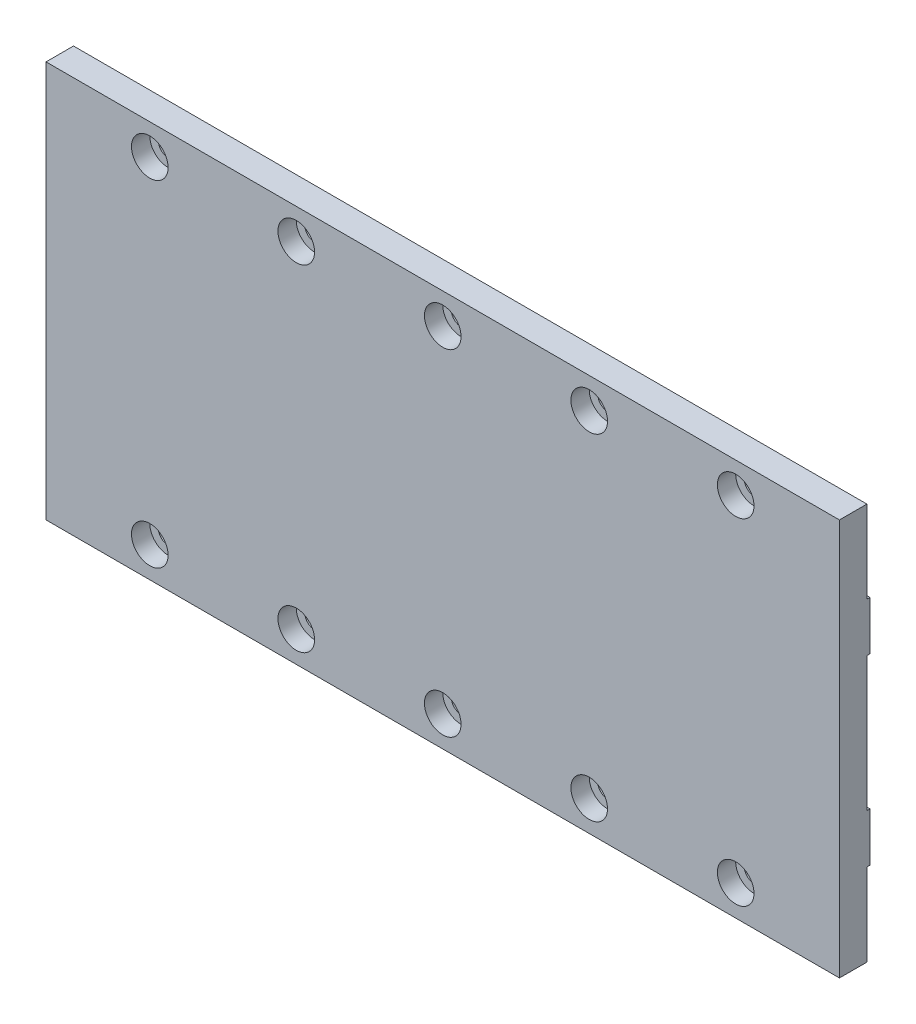
ISO-10303-21;
HEADER;
FILE_DESCRIPTION(('STEP AP214'),'2;1');
FILE_NAME('part.step','',(''),(''),'','','');
FILE_SCHEMA(('AUTOMOTIVE_DESIGN { 1 0 10303 214 1 1 1 1 }'));
ENDSEC;
DATA;
#1=APPLICATION_CONTEXT('core data for automotive mechanical design processes');
#2=APPLICATION_PROTOCOL_DEFINITION('international standard','automotive_design',2000,#1);
#3=PRODUCT_CONTEXT('',#1,'mechanical');
#4=PRODUCT('Part','Part','',(#3));
#5=PRODUCT_RELATED_PRODUCT_CATEGORY('part','',(#4));
#6=PRODUCT_DEFINITION_FORMATION('','',#4);
#7=PRODUCT_DEFINITION_CONTEXT('part definition',#1,'design');
#8=PRODUCT_DEFINITION('design','',#6,#7);
#9=PRODUCT_DEFINITION_SHAPE('','',#8);
#10=(LENGTH_UNIT() NAMED_UNIT(*) SI_UNIT(.MILLI.,.METRE.));
#11=(NAMED_UNIT(*) PLANE_ANGLE_UNIT() SI_UNIT($,.RADIAN.));
#12=(NAMED_UNIT(*) SI_UNIT($,.STERADIAN.) SOLID_ANGLE_UNIT());
#13=UNCERTAINTY_MEASURE_WITH_UNIT(LENGTH_MEASURE(1.E-05),#10,'distance_accuracy_value','');
#14=(GEOMETRIC_REPRESENTATION_CONTEXT(3) GLOBAL_UNCERTAINTY_ASSIGNED_CONTEXT((#13)) GLOBAL_UNIT_ASSIGNED_CONTEXT((#10,
#11,#12)) REPRESENTATION_CONTEXT('',''));
#15=CARTESIAN_POINT('',(0.,0.,0.));
#16=DIRECTION('',(0.,0.,1.));
#17=DIRECTION('',(1.,0.,0.));
#18=AXIS2_PLACEMENT_3D('',#15,#16,#17);
#19=CARTESIAN_POINT('',(113.,5.,5.));
#20=DIRECTION('',(0.,0.,-1.));
#21=DIRECTION('',(-1.,0.,0.));
#22=AXIS2_PLACEMENT_3D('',#19,#20,#21);
#23=CYLINDRICAL_SURFACE('',#22,1.59999999999999);
#24=CARTESIAN_POINT('',(113.,5.,0.5));
#25=DIRECTION('',(0.,0.,-1.));
#26=DIRECTION('',(-1.,0.,0.));
#27=AXIS2_PLACEMENT_3D('',#24,#25,#26);
#28=CIRCLE('',#27,1.59999999999999);
#29=CARTESIAN_POINT('',(111.4,5.,0.5));
#30=VERTEX_POINT('',#29);
#31=EDGE_CURVE('E249',#30,#30,#28,.T.);
#32=ORIENTED_EDGE('',*,*,#31,.T.);
#33=EDGE_LOOP('',(#32));
#34=FACE_BOUND('',#33,.T.);
#35=CARTESIAN_POINT('',(113.,5.,2.));
#36=DIRECTION('',(0.,0.,1.));
#37=DIRECTION('',(1.,0.,0.));
#38=AXIS2_PLACEMENT_3D('',#35,#36,#37);
#39=CIRCLE('',#38,1.59999999999999);
#40=CARTESIAN_POINT('',(114.6,5.,2.));
#41=VERTEX_POINT('',#40);
#42=EDGE_CURVE('E42',#41,#41,#39,.T.);
#43=ORIENTED_EDGE('',*,*,#42,.T.);
#44=EDGE_LOOP('',(#43));
#45=FACE_BOUND('',#44,.T.);
#46=ADVANCED_FACE('F38',(#34,#45),#23,.F.);
#47=CARTESIAN_POINT('',(89.,5.,5.));
#48=DIRECTION('',(0.,0.,-1.));
#49=DIRECTION('',(-1.,0.,0.));
#50=AXIS2_PLACEMENT_3D('',#47,#48,#49);
#51=CYLINDRICAL_SURFACE('',#50,1.60000000000001);
#52=CARTESIAN_POINT('',(89.,5.,0.5));
#53=DIRECTION('',(0.,0.,-1.));
#54=DIRECTION('',(-1.,0.,0.));
#55=AXIS2_PLACEMENT_3D('',#52,#53,#54);
#56=CIRCLE('',#55,1.60000000000001);
#57=CARTESIAN_POINT('',(87.4,5.,0.5));
#58=VERTEX_POINT('',#57);
#59=EDGE_CURVE('E245',#58,#58,#56,.T.);
#60=ORIENTED_EDGE('',*,*,#59,.T.);
#61=EDGE_LOOP('',(#60));
#62=FACE_BOUND('',#61,.T.);
#63=CARTESIAN_POINT('',(89.,5.,2.));
#64=DIRECTION('',(0.,0.,1.));
#65=DIRECTION('',(1.,0.,0.));
#66=AXIS2_PLACEMENT_3D('',#63,#64,#65);
#67=CIRCLE('',#66,1.60000000000001);
#68=CARTESIAN_POINT('',(90.6,5.,2.));
#69=VERTEX_POINT('',#68);
#70=EDGE_CURVE('E322',#69,#69,#67,.T.);
#71=ORIENTED_EDGE('',*,*,#70,.T.);
#72=EDGE_LOOP('',(#71));
#73=FACE_BOUND('',#72,.T.);
#74=ADVANCED_FACE('F436',(#62,#73),#51,.F.);
#75=CARTESIAN_POINT('',(65.,5.,5.));
#76=DIRECTION('',(0.,0.,-1.));
#77=DIRECTION('',(-1.,0.,0.));
#78=AXIS2_PLACEMENT_3D('',#75,#76,#77);
#79=CYLINDRICAL_SURFACE('',#78,1.60000000000001);
#80=CARTESIAN_POINT('',(65.,5.,0.5));
#81=DIRECTION('',(0.,0.,-1.));
#82=DIRECTION('',(-1.,0.,0.));
#83=AXIS2_PLACEMENT_3D('',#80,#81,#82);
#84=CIRCLE('',#83,1.60000000000001);
#85=CARTESIAN_POINT('',(63.4,5.,0.5));
#86=VERTEX_POINT('',#85);
#87=EDGE_CURVE('E241',#86,#86,#84,.T.);
#88=ORIENTED_EDGE('',*,*,#87,.T.);
#89=EDGE_LOOP('',(#88));
#90=FACE_BOUND('',#89,.T.);
#91=CARTESIAN_POINT('',(65.,5.,2.));
#92=DIRECTION('',(0.,0.,1.));
#93=DIRECTION('',(1.,0.,0.));
#94=AXIS2_PLACEMENT_3D('',#91,#92,#93);
#95=CIRCLE('',#94,1.60000000000001);
#96=CARTESIAN_POINT('',(66.6,5.,2.));
#97=VERTEX_POINT('',#96);
#98=EDGE_CURVE('E319',#97,#97,#95,.T.);
#99=ORIENTED_EDGE('',*,*,#98,.T.);
#100=EDGE_LOOP('',(#99));
#101=FACE_BOUND('',#100,.T.);
#102=ADVANCED_FACE('F443',(#90,#101),#79,.F.);
#103=CARTESIAN_POINT('',(41.,5.,5.));
#104=DIRECTION('',(0.,0.,-1.));
#105=DIRECTION('',(-1.,0.,0.));
#106=AXIS2_PLACEMENT_3D('',#103,#104,#105);
#107=CYLINDRICAL_SURFACE('',#106,1.6);
#108=CARTESIAN_POINT('',(41.,5.,0.5));
#109=DIRECTION('',(0.,0.,-1.));
#110=DIRECTION('',(-1.,0.,0.));
#111=AXIS2_PLACEMENT_3D('',#108,#109,#110);
#112=CIRCLE('',#111,1.6);
#113=CARTESIAN_POINT('',(39.4,5.,0.5));
#114=VERTEX_POINT('',#113);
#115=EDGE_CURVE('E237',#114,#114,#112,.T.);
#116=ORIENTED_EDGE('',*,*,#115,.T.);
#117=EDGE_LOOP('',(#116));
#118=FACE_BOUND('',#117,.T.);
#119=CARTESIAN_POINT('',(41.,5.,2.));
#120=DIRECTION('',(0.,0.,1.));
#121=DIRECTION('',(1.,0.,0.));
#122=AXIS2_PLACEMENT_3D('',#119,#120,#121);
#123=CIRCLE('',#122,1.6);
#124=CARTESIAN_POINT('',(42.6,5.,2.));
#125=VERTEX_POINT('',#124);
#126=EDGE_CURVE('E315',#125,#125,#123,.T.);
#127=ORIENTED_EDGE('',*,*,#126,.T.);
#128=EDGE_LOOP('',(#127));
#129=FACE_BOUND('',#128,.T.);
#130=ADVANCED_FACE('F595',(#118,#129),#107,.F.);
#131=CARTESIAN_POINT('',(17.,5.,5.));
#132=DIRECTION('',(0.,0.,-1.));
#133=DIRECTION('',(-1.,0.,0.));
#134=AXIS2_PLACEMENT_3D('',#131,#132,#133);
#135=CYLINDRICAL_SURFACE('',#134,1.6);
#136=CARTESIAN_POINT('',(17.,5.,0.5));
#137=DIRECTION('',(0.,0.,-1.));
#138=DIRECTION('',(-1.,0.,0.));
#139=AXIS2_PLACEMENT_3D('',#136,#137,#138);
#140=CIRCLE('',#139,1.6);
#141=CARTESIAN_POINT('',(15.4,5.,0.5));
#142=VERTEX_POINT('',#141);
#143=EDGE_CURVE('E236',#142,#142,#140,.T.);
#144=ORIENTED_EDGE('',*,*,#143,.T.);
#145=EDGE_LOOP('',(#144));
#146=FACE_BOUND('',#145,.T.);
#147=CARTESIAN_POINT('',(17.,5.,2.));
#148=DIRECTION('',(0.,0.,1.));
#149=DIRECTION('',(1.,0.,0.));
#150=AXIS2_PLACEMENT_3D('',#147,#148,#149);
#151=CIRCLE('',#150,1.6);
#152=CARTESIAN_POINT('',(18.6,5.,2.));
#153=VERTEX_POINT('',#152);
#154=EDGE_CURVE('E311',#153,#153,#151,.T.);
#155=ORIENTED_EDGE('',*,*,#154,.T.);
#156=EDGE_LOOP('',(#155));
#157=FACE_BOUND('',#156,.T.);
#158=ADVANCED_FACE('F585',(#146,#157),#135,.F.);
#159=CARTESIAN_POINT('',(113.,60.,5.));
#160=DIRECTION('',(0.,0.,-1.));
#161=DIRECTION('',(-1.,0.,0.));
#162=AXIS2_PLACEMENT_3D('',#159,#160,#161);
#163=CYLINDRICAL_SURFACE('',#162,1.60000000000001);
#164=CARTESIAN_POINT('',(113.,60.,0.5));
#165=DIRECTION('',(0.,0.,-1.));
#166=DIRECTION('',(-1.,0.,0.));
#167=AXIS2_PLACEMENT_3D('',#164,#165,#166);
#168=CIRCLE('',#167,1.60000000000001);
#169=CARTESIAN_POINT('',(111.4,60.,0.5));
#170=VERTEX_POINT('',#169);
#171=EDGE_CURVE('E232',#170,#170,#168,.T.);
#172=ORIENTED_EDGE('',*,*,#171,.T.);
#173=EDGE_LOOP('',(#172));
#174=FACE_BOUND('',#173,.T.);
#175=CARTESIAN_POINT('',(113.,60.,2.));
#176=DIRECTION('',(0.,0.,1.));
#177=DIRECTION('',(1.,0.,0.));
#178=AXIS2_PLACEMENT_3D('',#175,#176,#177);
#179=CIRCLE('',#178,1.60000000000001);
#180=CARTESIAN_POINT('',(114.6,60.,2.));
#181=VERTEX_POINT('',#180);
#182=EDGE_CURVE('E307',#181,#181,#179,.T.);
#183=ORIENTED_EDGE('',*,*,#182,.T.);
#184=EDGE_LOOP('',(#183));
#185=FACE_BOUND('',#184,.T.);
#186=ADVANCED_FACE('F575',(#174,#185),#163,.F.);
#187=CARTESIAN_POINT('',(89.,60.,5.));
#188=DIRECTION('',(0.,0.,-1.));
#189=DIRECTION('',(-1.,0.,0.));
#190=AXIS2_PLACEMENT_3D('',#187,#188,#189);
#191=CYLINDRICAL_SURFACE('',#190,1.60000000000001);
#192=CARTESIAN_POINT('',(89.,60.,0.5));
#193=DIRECTION('',(0.,0.,-1.));
#194=DIRECTION('',(-1.,0.,0.));
#195=AXIS2_PLACEMENT_3D('',#192,#193,#194);
#196=CIRCLE('',#195,1.60000000000001);
#197=CARTESIAN_POINT('',(87.4,60.,0.5));
#198=VERTEX_POINT('',#197);
#199=EDGE_CURVE('E228',#198,#198,#196,.T.);
#200=ORIENTED_EDGE('',*,*,#199,.T.);
#201=EDGE_LOOP('',(#200));
#202=FACE_BOUND('',#201,.T.);
#203=CARTESIAN_POINT('',(89.,60.,2.));
#204=DIRECTION('',(0.,0.,1.));
#205=DIRECTION('',(1.,0.,0.));
#206=AXIS2_PLACEMENT_3D('',#203,#204,#205);
#207=CIRCLE('',#206,1.60000000000001);
#208=CARTESIAN_POINT('',(90.6,60.,2.));
#209=VERTEX_POINT('',#208);
#210=EDGE_CURVE('E303',#209,#209,#207,.T.);
#211=ORIENTED_EDGE('',*,*,#210,.T.);
#212=EDGE_LOOP('',(#211));
#213=FACE_BOUND('',#212,.T.);
#214=ADVANCED_FACE('F565',(#202,#213),#191,.F.);
#215=CARTESIAN_POINT('',(65.,60.,5.));
#216=DIRECTION('',(0.,0.,-1.));
#217=DIRECTION('',(-1.,0.,0.));
#218=AXIS2_PLACEMENT_3D('',#215,#216,#217);
#219=CYLINDRICAL_SURFACE('',#218,1.60000000000001);
#220=CARTESIAN_POINT('',(65.,60.,0.5));
#221=DIRECTION('',(0.,0.,-1.));
#222=DIRECTION('',(-1.,0.,0.));
#223=AXIS2_PLACEMENT_3D('',#220,#221,#222);
#224=CIRCLE('',#223,1.60000000000001);
#225=CARTESIAN_POINT('',(63.4,60.,0.5));
#226=VERTEX_POINT('',#225);
#227=EDGE_CURVE('E224',#226,#226,#224,.T.);
#228=ORIENTED_EDGE('',*,*,#227,.T.);
#229=EDGE_LOOP('',(#228));
#230=FACE_BOUND('',#229,.T.);
#231=CARTESIAN_POINT('',(65.,60.,2.));
#232=DIRECTION('',(0.,0.,1.));
#233=DIRECTION('',(1.,0.,0.));
#234=AXIS2_PLACEMENT_3D('',#231,#232,#233);
#235=CIRCLE('',#234,1.60000000000001);
#236=CARTESIAN_POINT('',(66.6,60.,2.));
#237=VERTEX_POINT('',#236);
#238=EDGE_CURVE('E299',#237,#237,#235,.T.);
#239=ORIENTED_EDGE('',*,*,#238,.T.);
#240=EDGE_LOOP('',(#239));
#241=FACE_BOUND('',#240,.T.);
#242=ADVANCED_FACE('F555',(#230,#241),#219,.F.);
#243=CARTESIAN_POINT('',(41.,60.,5.));
#244=DIRECTION('',(0.,0.,-1.));
#245=DIRECTION('',(-1.,0.,0.));
#246=AXIS2_PLACEMENT_3D('',#243,#244,#245);
#247=CYLINDRICAL_SURFACE('',#246,1.6);
#248=CARTESIAN_POINT('',(41.,60.,0.5));
#249=DIRECTION('',(0.,0.,-1.));
#250=DIRECTION('',(-1.,0.,0.));
#251=AXIS2_PLACEMENT_3D('',#248,#249,#250);
#252=CIRCLE('',#251,1.6);
#253=CARTESIAN_POINT('',(39.4,60.,0.5));
#254=VERTEX_POINT('',#253);
#255=EDGE_CURVE('E220',#254,#254,#252,.T.);
#256=ORIENTED_EDGE('',*,*,#255,.T.);
#257=EDGE_LOOP('',(#256));
#258=FACE_BOUND('',#257,.T.);
#259=CARTESIAN_POINT('',(41.,60.,2.));
#260=DIRECTION('',(0.,0.,1.));
#261=DIRECTION('',(1.,0.,0.));
#262=AXIS2_PLACEMENT_3D('',#259,#260,#261);
#263=CIRCLE('',#262,1.6);
#264=CARTESIAN_POINT('',(42.6,60.,2.));
#265=VERTEX_POINT('',#264);
#266=EDGE_CURVE('E294',#265,#265,#263,.T.);
#267=ORIENTED_EDGE('',*,*,#266,.T.);
#268=EDGE_LOOP('',(#267));
#269=FACE_BOUND('',#268,.T.);
#270=ADVANCED_FACE('F545',(#258,#269),#247,.F.);
#271=CARTESIAN_POINT('',(17.,60.,5.));
#272=DIRECTION('',(0.,0.,-1.));
#273=DIRECTION('',(-1.,0.,0.));
#274=AXIS2_PLACEMENT_3D('',#271,#272,#273);
#275=CYLINDRICAL_SURFACE('',#274,1.6);
#276=CARTESIAN_POINT('',(17.,60.,0.5));
#277=DIRECTION('',(0.,0.,-1.));
#278=DIRECTION('',(-1.,0.,0.));
#279=AXIS2_PLACEMENT_3D('',#276,#277,#278);
#280=CIRCLE('',#279,1.6);
#281=CARTESIAN_POINT('',(15.4,60.,0.5));
#282=VERTEX_POINT('',#281);
#283=EDGE_CURVE('E163',#282,#282,#280,.T.);
#284=ORIENTED_EDGE('',*,*,#283,.T.);
#285=EDGE_LOOP('',(#284));
#286=FACE_BOUND('',#285,.T.);
#287=CARTESIAN_POINT('',(17.,60.,2.));
#288=DIRECTION('',(0.,0.,1.));
#289=DIRECTION('',(1.,0.,0.));
#290=AXIS2_PLACEMENT_3D('',#287,#288,#289);
#291=CIRCLE('',#290,1.6);
#292=CARTESIAN_POINT('',(18.6,60.,2.));
#293=VERTEX_POINT('',#292);
#294=EDGE_CURVE('E290',#293,#293,#291,.T.);
#295=ORIENTED_EDGE('',*,*,#294,.T.);
#296=EDGE_LOOP('',(#295));
#297=FACE_BOUND('',#296,.T.);
#298=ADVANCED_FACE('F465',(#286,#297),#275,.F.);
#299=CARTESIAN_POINT('',(0.,0.,0.));
#300=DIRECTION('',(0.,0.,-1.));
#301=DIRECTION('',(-1.,0.,0.));
#302=AXIS2_PLACEMENT_3D('',#299,#300,#301);
#303=PLANE('',#302);
#304=DIRECTION('',(-1.,0.,0.));
#305=VECTOR('',#304,1.);
#306=CARTESIAN_POINT('',(130.,51.5,0.));
#307=LINE('',#306,#305);
#308=CARTESIAN_POINT('',(130.,51.5,0.));
#309=VERTEX_POINT('',#308);
#310=CARTESIAN_POINT('',(0.,51.5,0.));
#311=VERTEX_POINT('',#310);
#312=EDGE_CURVE('E152',#309,#311,#307,.T.);
#313=ORIENTED_EDGE('',*,*,#312,.F.);
#314=DIRECTION('',(0.,1.,0.));
#315=VECTOR('',#314,1.);
#316=CARTESIAN_POINT('',(130.,0.,0.));
#317=LINE('',#316,#315);
#318=CARTESIAN_POINT('',(130.,43.5,0.));
#319=VERTEX_POINT('',#318);
#320=EDGE_CURVE('E158',#319,#309,#317,.T.);
#321=ORIENTED_EDGE('',*,*,#320,.F.);
#322=DIRECTION('',(1.,0.,0.));
#323=VECTOR('',#322,1.);
#324=CARTESIAN_POINT('',(130.,43.5,0.));
#325=LINE('',#324,#323);
#326=CARTESIAN_POINT('',(0.,43.5,0.));
#327=VERTEX_POINT('',#326);
#328=EDGE_CURVE('E194',#327,#319,#325,.T.);
#329=ORIENTED_EDGE('',*,*,#328,.F.);
#330=DIRECTION('',(0.,-1.,0.));
#331=VECTOR('',#330,1.);
#332=CARTESIAN_POINT('',(0.,0.,0.));
#333=LINE('',#332,#331);
#334=EDGE_CURVE('E272',#311,#327,#333,.T.);
#335=ORIENTED_EDGE('',*,*,#334,.F.);
#336=EDGE_LOOP('',(#313,#321,#329,#335));
#337=FACE_BOUND('',#336,.T.);
#338=ADVANCED_FACE('F403',(#337),#303,.T.);
#339=CARTESIAN_POINT('',(0.,0.,5.));
#340=DIRECTION('',(0.,1.,0.));
#341=DIRECTION('',(0.,0.,1.));
#342=AXIS2_PLACEMENT_3D('',#339,#340,#341);
#343=PLANE('',#342);
#344=DIRECTION('',(-1.,0.,0.));
#345=VECTOR('',#344,1.);
#346=CARTESIAN_POINT('',(0.,0.,0.5));
#347=LINE('',#346,#345);
#348=CARTESIAN_POINT('',(130.,0.,0.5));
#349=VERTEX_POINT('',#348);
#350=CARTESIAN_POINT('',(0.,0.,0.5));
#351=VERTEX_POINT('',#350);
#352=EDGE_CURVE('E177',#349,#351,#347,.T.);
#353=ORIENTED_EDGE('',*,*,#352,.F.);
#354=DIRECTION('',(0.,0.,-1.));
#355=VECTOR('',#354,1.);
#356=CARTESIAN_POINT('',(130.,0.,5.));
#357=LINE('',#356,#355);
#358=CARTESIAN_POINT('',(130.,0.,5.));
#359=VERTEX_POINT('',#358);
#360=EDGE_CURVE('E48',#359,#349,#357,.T.);
#361=ORIENTED_EDGE('',*,*,#360,.F.);
#362=DIRECTION('',(1.,0.,0.));
#363=VECTOR('',#362,1.);
#364=CARTESIAN_POINT('',(0.,0.,5.));
#365=LINE('',#364,#363);
#366=CARTESIAN_POINT('',(0.,0.,5.));
#367=VERTEX_POINT('',#366);
#368=EDGE_CURVE('E258',#367,#359,#365,.T.);
#369=ORIENTED_EDGE('',*,*,#368,.F.);
#370=DIRECTION('',(0.,0.,-1.));
#371=VECTOR('',#370,1.);
#372=CARTESIAN_POINT('',(0.,0.,5.));
#373=LINE('',#372,#371);
#374=EDGE_CURVE('E11',#367,#351,#373,.T.);
#375=ORIENTED_EDGE('',*,*,#374,.T.);
#376=EDGE_LOOP('',(#353,#361,#369,#375));
#377=FACE_BOUND('',#376,.T.);
#378=ADVANCED_FACE('F457',(#377),#343,.F.);
#379=CARTESIAN_POINT('',(0.,65.,5.));
#380=DIRECTION('',(0.,-1.,0.));
#381=DIRECTION('',(0.,0.,-1.));
#382=AXIS2_PLACEMENT_3D('',#379,#380,#381);
#383=PLANE('',#382);
#384=DIRECTION('',(1.,0.,0.));
#385=VECTOR('',#384,1.);
#386=CARTESIAN_POINT('',(130.,65.,0.5));
#387=LINE('',#386,#385);
#388=CARTESIAN_POINT('',(0.,65.,0.5));
#389=VERTEX_POINT('',#388);
#390=CARTESIAN_POINT('',(130.,65.,0.5));
#391=VERTEX_POINT('',#390);
#392=EDGE_CURVE('E147',#389,#391,#387,.T.);
#393=ORIENTED_EDGE('',*,*,#392,.F.);
#394=DIRECTION('',(0.,0.,-1.));
#395=VECTOR('',#394,1.);
#396=CARTESIAN_POINT('',(0.,65.,5.));
#397=LINE('',#396,#395);
#398=CARTESIAN_POINT('',(0.,65.,5.));
#399=VERTEX_POINT('',#398);
#400=EDGE_CURVE('E268',#399,#389,#397,.T.);
#401=ORIENTED_EDGE('',*,*,#400,.F.);
#402=DIRECTION('',(-1.,0.,0.));
#403=VECTOR('',#402,1.);
#404=CARTESIAN_POINT('',(0.,65.,5.));
#405=LINE('',#404,#403);
#406=CARTESIAN_POINT('',(130.,65.,5.));
#407=VERTEX_POINT('',#406);
#408=EDGE_CURVE('E265',#407,#399,#405,.T.);
#409=ORIENTED_EDGE('',*,*,#408,.F.);
#410=DIRECTION('',(0.,0.,-1.));
#411=VECTOR('',#410,1.);
#412=CARTESIAN_POINT('',(130.,65.,5.));
#413=LINE('',#412,#411);
#414=EDGE_CURVE('E278',#407,#391,#413,.T.);
#415=ORIENTED_EDGE('',*,*,#414,.T.);
#416=EDGE_LOOP('',(#393,#401,#409,#415));
#417=FACE_BOUND('',#416,.T.);
#418=ADVANCED_FACE('F451',(#417),#383,.F.);
#419=CARTESIAN_POINT('',(0.,0.,5.));
#420=DIRECTION('',(0.,0.,-1.));
#421=DIRECTION('',(-1.,0.,0.));
#422=AXIS2_PLACEMENT_3D('',#419,#420,#421);
#423=PLANE('',#422);
#424=CARTESIAN_POINT('',(17.,5.,5.));
#425=DIRECTION('',(0.,0.,1.));
#426=DIRECTION('',(1.,0.,0.));
#427=AXIS2_PLACEMENT_3D('',#424,#425,#426);
#428=CIRCLE('',#427,3.);
#429=CARTESIAN_POINT('',(20.,5.,5.));
#430=VERTEX_POINT('',#429);
#431=EDGE_CURVE('E383',#430,#430,#428,.T.);
#432=ORIENTED_EDGE('',*,*,#431,.F.);
#433=EDGE_LOOP('',(#432));
#434=FACE_BOUND('',#433,.T.);
#435=CARTESIAN_POINT('',(41.,5.,5.));
#436=DIRECTION('',(0.,0.,1.));
#437=DIRECTION('',(1.,0.,0.));
#438=AXIS2_PLACEMENT_3D('',#435,#436,#437);
#439=CIRCLE('',#438,3.);
#440=CARTESIAN_POINT('',(44.,5.,5.));
#441=VERTEX_POINT('',#440);
#442=EDGE_CURVE('E375',#441,#441,#439,.T.);
#443=ORIENTED_EDGE('',*,*,#442,.F.);
#444=EDGE_LOOP('',(#443));
#445=FACE_BOUND('',#444,.T.);
#446=CARTESIAN_POINT('',(65.,5.,5.));
#447=DIRECTION('',(0.,0.,1.));
#448=DIRECTION('',(1.,0.,0.));
#449=AXIS2_PLACEMENT_3D('',#446,#447,#448);
#450=CIRCLE('',#449,3.00000000000001);
#451=CARTESIAN_POINT('',(68.,5.,5.));
#452=VERTEX_POINT('',#451);
#453=EDGE_CURVE('E367',#452,#452,#450,.T.);
#454=ORIENTED_EDGE('',*,*,#453,.F.);
#455=EDGE_LOOP('',(#454));
#456=FACE_BOUND('',#455,.T.);
#457=CARTESIAN_POINT('',(89.,5.,5.));
#458=DIRECTION('',(0.,0.,1.));
#459=DIRECTION('',(1.,0.,0.));
#460=AXIS2_PLACEMENT_3D('',#457,#458,#459);
#461=CIRCLE('',#460,3.00000000000001);
#462=CARTESIAN_POINT('',(92.,5.,5.));
#463=VERTEX_POINT('',#462);
#464=EDGE_CURVE('E359',#463,#463,#461,.T.);
#465=ORIENTED_EDGE('',*,*,#464,.F.);
#466=EDGE_LOOP('',(#465));
#467=FACE_BOUND('',#466,.T.);
#468=CARTESIAN_POINT('',(113.,5.,5.));
#469=DIRECTION('',(0.,0.,1.));
#470=DIRECTION('',(1.,0.,0.));
#471=AXIS2_PLACEMENT_3D('',#468,#469,#470);
#472=CIRCLE('',#471,3.00000000000001);
#473=CARTESIAN_POINT('',(116.,5.,5.));
#474=VERTEX_POINT('',#473);
#475=EDGE_CURVE('E344',#474,#474,#472,.T.);
#476=ORIENTED_EDGE('',*,*,#475,.F.);
#477=EDGE_LOOP('',(#476));
#478=FACE_BOUND('',#477,.T.);
#479=CARTESIAN_POINT('',(113.,60.,5.));
#480=DIRECTION('',(0.,0.,1.));
#481=DIRECTION('',(1.,0.,0.));
#482=AXIS2_PLACEMENT_3D('',#479,#480,#481);
#483=CIRCLE('',#482,3.00000000000001);
#484=CARTESIAN_POINT('',(116.,60.,5.));
#485=VERTEX_POINT('',#484);
#486=EDGE_CURVE('E343',#485,#485,#483,.T.);
#487=ORIENTED_EDGE('',*,*,#486,.F.);
#488=EDGE_LOOP('',(#487));
#489=FACE_BOUND('',#488,.T.);
#490=CARTESIAN_POINT('',(89.,60.,5.));
#491=DIRECTION('',(0.,0.,1.));
#492=DIRECTION('',(1.,0.,0.));
#493=AXIS2_PLACEMENT_3D('',#490,#491,#492);
#494=CIRCLE('',#493,3.00000000000001);
#495=CARTESIAN_POINT('',(92.,60.,5.));
#496=VERTEX_POINT('',#495);
#497=EDGE_CURVE('E825',#496,#496,#494,.T.);
#498=ORIENTED_EDGE('',*,*,#497,.F.);
#499=EDGE_LOOP('',(#498));
#500=FACE_BOUND('',#499,.T.);
#501=CARTESIAN_POINT('',(65.,60.,5.));
#502=DIRECTION('',(0.,0.,1.));
#503=DIRECTION('',(1.,0.,0.));
#504=AXIS2_PLACEMENT_3D('',#501,#502,#503);
#505=CIRCLE('',#504,3.00000000000001);
#506=CARTESIAN_POINT('',(68.,60.,5.));
#507=VERTEX_POINT('',#506);
#508=EDGE_CURVE('E829',#507,#507,#505,.T.);
#509=ORIENTED_EDGE('',*,*,#508,.F.);
#510=EDGE_LOOP('',(#509));
#511=FACE_BOUND('',#510,.T.);
#512=CARTESIAN_POINT('',(41.,60.,5.));
#513=DIRECTION('',(0.,0.,1.));
#514=DIRECTION('',(1.,0.,0.));
#515=AXIS2_PLACEMENT_3D('',#512,#513,#514);
#516=CIRCLE('',#515,3.);
#517=CARTESIAN_POINT('',(44.,60.,5.));
#518=VERTEX_POINT('',#517);
#519=EDGE_CURVE('E833',#518,#518,#516,.T.);
#520=ORIENTED_EDGE('',*,*,#519,.F.);
#521=EDGE_LOOP('',(#520));
#522=FACE_BOUND('',#521,.T.);
#523=CARTESIAN_POINT('',(17.,60.,5.));
#524=DIRECTION('',(0.,0.,1.));
#525=DIRECTION('',(1.,0.,0.));
#526=AXIS2_PLACEMENT_3D('',#523,#524,#525);
#527=CIRCLE('',#526,3.);
#528=CARTESIAN_POINT('',(20.,60.,5.));
#529=VERTEX_POINT('',#528);
#530=EDGE_CURVE('E390',#529,#529,#527,.T.);
#531=ORIENTED_EDGE('',*,*,#530,.F.);
#532=EDGE_LOOP('',(#531));
#533=FACE_BOUND('',#532,.T.);
#534=DIRECTION('',(0.,-1.,0.));
#535=VECTOR('',#534,1.);
#536=CARTESIAN_POINT('',(0.,0.,5.));
#537=LINE('',#536,#535);
#538=EDGE_CURVE('E254',#399,#367,#537,.T.);
#539=ORIENTED_EDGE('',*,*,#538,.T.);
#540=ORIENTED_EDGE('',*,*,#368,.T.);
#541=DIRECTION('',(0.,1.,0.));
#542=VECTOR('',#541,1.);
#543=CARTESIAN_POINT('',(130.,0.,5.));
#544=LINE('',#543,#542);
#545=EDGE_CURVE('E262',#359,#407,#544,.T.);
#546=ORIENTED_EDGE('',*,*,#545,.T.);
#547=ORIENTED_EDGE('',*,*,#408,.T.);
#548=EDGE_LOOP('',(#539,#540,#546,#547));
#549=FACE_BOUND('',#548,.T.);
#550=ADVANCED_FACE('F448',(#434,#445,#456,#467,#478,#489,#500,#511,#522,#533,#549),#423,.F.);
#551=DIRECTION('',(1.,0.,0.));
#552=VECTOR('',#551,1.);
#553=CARTESIAN_POINT('',(0.,13.5,0.));
#554=LINE('',#553,#552);
#555=CARTESIAN_POINT('',(0.,13.5,0.));
#556=VERTEX_POINT('',#555);
#557=CARTESIAN_POINT('',(130.,13.5,0.));
#558=VERTEX_POINT('',#557);
#559=EDGE_CURVE('E171',#556,#558,#554,.T.);
#560=ORIENTED_EDGE('',*,*,#559,.F.);
#561=CARTESIAN_POINT('',(0.,21.5,0.));
#562=VERTEX_POINT('',#561);
#563=EDGE_CURVE('E253',#562,#556,#333,.T.);
#564=ORIENTED_EDGE('',*,*,#563,.F.);
#565=DIRECTION('',(-1.,0.,0.));
#566=VECTOR('',#565,1.);
#567=CARTESIAN_POINT('',(130.,21.5,0.));
#568=LINE('',#567,#566);
#569=CARTESIAN_POINT('',(130.,21.5,0.));
#570=VERTEX_POINT('',#569);
#571=EDGE_CURVE('E204',#570,#562,#568,.T.);
#572=ORIENTED_EDGE('',*,*,#571,.F.);
#573=EDGE_CURVE('E259',#558,#570,#317,.T.);
#574=ORIENTED_EDGE('',*,*,#573,.F.);
#575=EDGE_LOOP('',(#560,#564,#572,#574));
#576=FACE_BOUND('',#575,.T.);
#577=ADVANCED_FACE('F414',(#576),#303,.T.);
#578=CARTESIAN_POINT('',(0.,0.,5.));
#579=DIRECTION('',(1.,0.,0.));
#580=DIRECTION('',(0.,0.,-1.));
#581=AXIS2_PLACEMENT_3D('',#578,#579,#580);
#582=PLANE('',#581);
#583=DIRECTION('',(0.,1.,0.));
#584=VECTOR('',#583,1.);
#585=CARTESIAN_POINT('',(0.,65.,0.5));
#586=LINE('',#585,#584);
#587=CARTESIAN_POINT('',(0.,51.5,0.5));
#588=VERTEX_POINT('',#587);
#589=EDGE_CURVE('E141',#588,#389,#586,.T.);
#590=ORIENTED_EDGE('',*,*,#589,.F.);
#591=DIRECTION('',(0.,0.,-1.));
#592=VECTOR('',#591,1.);
#593=CARTESIAN_POINT('',(0.,51.5,0.5));
#594=LINE('',#593,#592);
#595=EDGE_CURVE('E137',#588,#311,#594,.T.);
#596=ORIENTED_EDGE('',*,*,#595,.T.);
#597=ORIENTED_EDGE('',*,*,#334,.T.);
#598=DIRECTION('',(0.,0.,-1.));
#599=VECTOR('',#598,1.);
#600=CARTESIAN_POINT('',(0.,43.5,0.5));
#601=LINE('',#600,#599);
#602=CARTESIAN_POINT('',(0.,43.5,0.5));
#603=VERTEX_POINT('',#602);
#604=EDGE_CURVE('E211',#603,#327,#601,.T.);
#605=ORIENTED_EDGE('',*,*,#604,.F.);
#606=DIRECTION('',(0.,1.,0.));
#607=VECTOR('',#606,1.);
#608=CARTESIAN_POINT('',(0.,43.5,0.5));
#609=LINE('',#608,#607);
#610=CARTESIAN_POINT('',(0.,21.5,0.5));
#611=VERTEX_POINT('',#610);
#612=EDGE_CURVE('E198',#611,#603,#609,.T.);
#613=ORIENTED_EDGE('',*,*,#612,.F.);
#614=DIRECTION('',(0.,0.,-1.));
#615=VECTOR('',#614,1.);
#616=CARTESIAN_POINT('',(0.,21.5,0.5));
#617=LINE('',#616,#615);
#618=EDGE_CURVE('E214',#611,#562,#617,.T.);
#619=ORIENTED_EDGE('',*,*,#618,.T.);
#620=ORIENTED_EDGE('',*,*,#563,.T.);
#621=DIRECTION('',(0.,0.,-1.));
#622=VECTOR('',#621,1.);
#623=CARTESIAN_POINT('',(0.,13.5,0.5));
#624=LINE('',#623,#622);
#625=CARTESIAN_POINT('',(0.,13.5,0.5));
#626=VERTEX_POINT('',#625);
#627=EDGE_CURVE('E180',#626,#556,#624,.T.);
#628=ORIENTED_EDGE('',*,*,#627,.F.);
#629=DIRECTION('',(0.,1.,0.));
#630=VECTOR('',#629,1.);
#631=CARTESIAN_POINT('',(0.,0.,0.5));
#632=LINE('',#631,#630);
#633=EDGE_CURVE('E168',#351,#626,#632,.T.);
#634=ORIENTED_EDGE('',*,*,#633,.F.);
#635=ORIENTED_EDGE('',*,*,#374,.F.);
#636=ORIENTED_EDGE('',*,*,#538,.F.);
#637=ORIENTED_EDGE('',*,*,#400,.T.);
#638=EDGE_LOOP('',(#590,#596,#597,#605,#613,#619,#620,#628,#634,#635,#636,#637));
#639=FACE_BOUND('',#638,.T.);
#640=ADVANCED_FACE('F40',(#639),#582,.F.);
#641=CARTESIAN_POINT('',(130.,0.,5.));
#642=DIRECTION('',(-1.,0.,0.));
#643=DIRECTION('',(0.,0.,1.));
#644=AXIS2_PLACEMENT_3D('',#641,#642,#643);
#645=PLANE('',#644);
#646=ORIENTED_EDGE('',*,*,#320,.T.);
#647=DIRECTION('',(0.,0.,-1.));
#648=VECTOR('',#647,1.);
#649=CARTESIAN_POINT('',(130.,51.5,0.5));
#650=LINE('',#649,#648);
#651=CARTESIAN_POINT('',(130.,51.5,0.5));
#652=VERTEX_POINT('',#651);
#653=EDGE_CURVE('E134',#652,#309,#650,.T.);
#654=ORIENTED_EDGE('',*,*,#653,.F.);
#655=DIRECTION('',(0.,-1.,0.));
#656=VECTOR('',#655,1.);
#657=CARTESIAN_POINT('',(130.,65.,0.5));
#658=LINE('',#657,#656);
#659=EDGE_CURVE('E142',#391,#652,#658,.T.);
#660=ORIENTED_EDGE('',*,*,#659,.F.);
#661=ORIENTED_EDGE('',*,*,#414,.F.);
#662=ORIENTED_EDGE('',*,*,#545,.F.);
#663=ORIENTED_EDGE('',*,*,#360,.T.);
#664=DIRECTION('',(0.,-1.,0.));
#665=VECTOR('',#664,1.);
#666=CARTESIAN_POINT('',(130.,0.,0.5));
#667=LINE('',#666,#665);
#668=CARTESIAN_POINT('',(130.,13.5,0.5));
#669=VERTEX_POINT('',#668);
#670=EDGE_CURVE('E174',#669,#349,#667,.T.);
#671=ORIENTED_EDGE('',*,*,#670,.F.);
#672=DIRECTION('',(0.,0.,-1.));
#673=VECTOR('',#672,1.);
#674=CARTESIAN_POINT('',(130.,13.5,0.5));
#675=LINE('',#674,#673);
#676=EDGE_CURVE('E184',#669,#558,#675,.T.);
#677=ORIENTED_EDGE('',*,*,#676,.T.);
#678=ORIENTED_EDGE('',*,*,#573,.T.);
#679=DIRECTION('',(0.,0.,-1.));
#680=VECTOR('',#679,1.);
#681=CARTESIAN_POINT('',(130.,21.5,0.5));
#682=LINE('',#681,#680);
#683=CARTESIAN_POINT('',(130.,21.5,0.5));
#684=VERTEX_POINT('',#683);
#685=EDGE_CURVE('E203',#684,#570,#682,.T.);
#686=ORIENTED_EDGE('',*,*,#685,.F.);
#687=DIRECTION('',(0.,-1.,0.));
#688=VECTOR('',#687,1.);
#689=CARTESIAN_POINT('',(130.,43.5,0.5));
#690=LINE('',#689,#688);
#691=CARTESIAN_POINT('',(130.,43.5,0.5));
#692=VERTEX_POINT('',#691);
#693=EDGE_CURVE('E190',#692,#684,#690,.T.);
#694=ORIENTED_EDGE('',*,*,#693,.F.);
#695=DIRECTION('',(0.,0.,-1.));
#696=VECTOR('',#695,1.);
#697=CARTESIAN_POINT('',(130.,43.5,0.5));
#698=LINE('',#697,#696);
#699=EDGE_CURVE('E183',#692,#319,#698,.T.);
#700=ORIENTED_EDGE('',*,*,#699,.T.);
#701=EDGE_LOOP('',(#646,#654,#660,#661,#662,#663,#671,#677,#678,#686,#694,#700));
#702=FACE_BOUND('',#701,.T.);
#703=ADVANCED_FACE('F155',(#702),#645,.F.);
#704=CARTESIAN_POINT('',(130.,51.5,0.5));
#705=DIRECTION('',(0.,-1.,0.));
#706=DIRECTION('',(0.,0.,-1.));
#707=AXIS2_PLACEMENT_3D('',#704,#705,#706);
#708=PLANE('',#707);
#709=ORIENTED_EDGE('',*,*,#312,.T.);
#710=ORIENTED_EDGE('',*,*,#595,.F.);
#711=DIRECTION('',(-1.,0.,0.));
#712=VECTOR('',#711,1.);
#713=CARTESIAN_POINT('',(130.,51.5,0.5));
#714=LINE('',#713,#712);
#715=EDGE_CURVE('E130',#652,#588,#714,.T.);
#716=ORIENTED_EDGE('',*,*,#715,.F.);
#717=ORIENTED_EDGE('',*,*,#653,.T.);
#718=EDGE_LOOP('',(#709,#710,#716,#717));
#719=FACE_BOUND('',#718,.T.);
#720=ADVANCED_FACE('F132',(#719),#708,.F.);
#721=CARTESIAN_POINT('',(0.,0.,0.5));
#722=DIRECTION('',(0.,0.,-1.));
#723=DIRECTION('',(-1.,0.,0.));
#724=AXIS2_PLACEMENT_3D('',#721,#722,#723);
#725=PLANE('',#724);
#726=ORIENTED_EDGE('',*,*,#171,.F.);
#727=EDGE_LOOP('',(#726));
#728=FACE_BOUND('',#727,.T.);
#729=ORIENTED_EDGE('',*,*,#199,.F.);
#730=EDGE_LOOP('',(#729));
#731=FACE_BOUND('',#730,.T.);
#732=ORIENTED_EDGE('',*,*,#227,.F.);
#733=EDGE_LOOP('',(#732));
#734=FACE_BOUND('',#733,.T.);
#735=ORIENTED_EDGE('',*,*,#255,.F.);
#736=EDGE_LOOP('',(#735));
#737=FACE_BOUND('',#736,.T.);
#738=ORIENTED_EDGE('',*,*,#283,.F.);
#739=EDGE_LOOP('',(#738));
#740=FACE_BOUND('',#739,.T.);
#741=ORIENTED_EDGE('',*,*,#659,.T.);
#742=ORIENTED_EDGE('',*,*,#715,.T.);
#743=ORIENTED_EDGE('',*,*,#589,.T.);
#744=ORIENTED_EDGE('',*,*,#392,.T.);
#745=EDGE_LOOP('',(#741,#742,#743,#744));
#746=FACE_BOUND('',#745,.T.);
#747=ADVANCED_FACE('F145',(#728,#731,#734,#737,#740,#746),#725,.T.);
#748=CARTESIAN_POINT('',(0.,13.5,0.5));
#749=DIRECTION('',(0.,1.,0.));
#750=DIRECTION('',(-1.,0.,0.));
#751=AXIS2_PLACEMENT_3D('',#748,#749,#750);
#752=PLANE('',#751);
#753=ORIENTED_EDGE('',*,*,#559,.T.);
#754=ORIENTED_EDGE('',*,*,#676,.F.);
#755=DIRECTION('',(1.,0.,0.));
#756=VECTOR('',#755,1.);
#757=CARTESIAN_POINT('',(0.,13.5,0.5));
#758=LINE('',#757,#756);
#759=EDGE_CURVE('E56',#626,#669,#758,.T.);
#760=ORIENTED_EDGE('',*,*,#759,.F.);
#761=ORIENTED_EDGE('',*,*,#627,.T.);
#762=EDGE_LOOP('',(#753,#754,#760,#761));
#763=FACE_BOUND('',#762,.T.);
#764=ADVANCED_FACE('F431',(#763),#752,.F.);
#765=CARTESIAN_POINT('',(0.,0.,0.5));
#766=DIRECTION('',(0.,0.,-1.));
#767=DIRECTION('',(-1.,0.,0.));
#768=AXIS2_PLACEMENT_3D('',#765,#766,#767);
#769=PLANE('',#768);
#770=ORIENTED_EDGE('',*,*,#31,.F.);
#771=EDGE_LOOP('',(#770));
#772=FACE_BOUND('',#771,.T.);
#773=ORIENTED_EDGE('',*,*,#59,.F.);
#774=EDGE_LOOP('',(#773));
#775=FACE_BOUND('',#774,.T.);
#776=ORIENTED_EDGE('',*,*,#87,.F.);
#777=EDGE_LOOP('',(#776));
#778=FACE_BOUND('',#777,.T.);
#779=ORIENTED_EDGE('',*,*,#115,.F.);
#780=EDGE_LOOP('',(#779));
#781=FACE_BOUND('',#780,.T.);
#782=ORIENTED_EDGE('',*,*,#143,.F.);
#783=EDGE_LOOP('',(#782));
#784=FACE_BOUND('',#783,.T.);
#785=ORIENTED_EDGE('',*,*,#633,.T.);
#786=ORIENTED_EDGE('',*,*,#759,.T.);
#787=ORIENTED_EDGE('',*,*,#670,.T.);
#788=ORIENTED_EDGE('',*,*,#352,.T.);
#789=EDGE_LOOP('',(#785,#786,#787,#788));
#790=FACE_BOUND('',#789,.T.);
#791=ADVANCED_FACE('F424',(#772,#775,#778,#781,#784,#790),#769,.T.);
#792=CARTESIAN_POINT('',(130.,43.5,0.5));
#793=DIRECTION('',(0.,1.,0.));
#794=DIRECTION('',(0.,0.,1.));
#795=AXIS2_PLACEMENT_3D('',#792,#793,#794);
#796=PLANE('',#795);
#797=ORIENTED_EDGE('',*,*,#328,.T.);
#798=ORIENTED_EDGE('',*,*,#699,.F.);
#799=DIRECTION('',(1.,0.,0.));
#800=VECTOR('',#799,1.);
#801=CARTESIAN_POINT('',(130.,43.5,0.5));
#802=LINE('',#801,#800);
#803=EDGE_CURVE('E64',#603,#692,#802,.T.);
#804=ORIENTED_EDGE('',*,*,#803,.F.);
#805=ORIENTED_EDGE('',*,*,#604,.T.);
#806=EDGE_LOOP('',(#797,#798,#804,#805));
#807=FACE_BOUND('',#806,.T.);
#808=ADVANCED_FACE('F422',(#807),#796,.F.);
#809=CARTESIAN_POINT('',(130.,21.5,0.5));
#810=DIRECTION('',(0.,-1.,0.));
#811=DIRECTION('',(0.,0.,-1.));
#812=AXIS2_PLACEMENT_3D('',#809,#810,#811);
#813=PLANE('',#812);
#814=ORIENTED_EDGE('',*,*,#571,.T.);
#815=ORIENTED_EDGE('',*,*,#618,.F.);
#816=DIRECTION('',(-1.,0.,0.));
#817=VECTOR('',#816,1.);
#818=CARTESIAN_POINT('',(130.,21.5,0.5));
#819=LINE('',#818,#817);
#820=EDGE_CURVE('E193',#684,#611,#819,.T.);
#821=ORIENTED_EDGE('',*,*,#820,.F.);
#822=ORIENTED_EDGE('',*,*,#685,.T.);
#823=EDGE_LOOP('',(#814,#815,#821,#822));
#824=FACE_BOUND('',#823,.T.);
#825=ADVANCED_FACE('F417',(#824),#813,.F.);
#826=CARTESIAN_POINT('',(0.,0.,0.5));
#827=DIRECTION('',(0.,0.,-1.));
#828=DIRECTION('',(-1.,0.,0.));
#829=AXIS2_PLACEMENT_3D('',#826,#827,#828);
#830=PLANE('',#829);
#831=ORIENTED_EDGE('',*,*,#693,.T.);
#832=ORIENTED_EDGE('',*,*,#820,.T.);
#833=ORIENTED_EDGE('',*,*,#612,.T.);
#834=ORIENTED_EDGE('',*,*,#803,.T.);
#835=EDGE_LOOP('',(#831,#832,#833,#834));
#836=FACE_BOUND('',#835,.T.);
#837=ADVANCED_FACE('F420',(#836),#830,.T.);
#838=CARTESIAN_POINT('',(17.,60.,2.));
#839=DIRECTION('',(0.,0.,1.));
#840=DIRECTION('',(1.,0.,0.));
#841=AXIS2_PLACEMENT_3D('',#838,#839,#840);
#842=CYLINDRICAL_SURFACE('',#841,3.);
#843=CARTESIAN_POINT('',(17.,60.,2.));
#844=DIRECTION('',(0.,0.,1.));
#845=DIRECTION('',(1.,0.,0.));
#846=AXIS2_PLACEMENT_3D('',#843,#844,#845);
#847=CIRCLE('',#846,3.);
#848=CARTESIAN_POINT('',(20.,60.,2.));
#849=VERTEX_POINT('',#848);
#850=EDGE_CURVE('E295',#849,#849,#847,.T.);
#851=ORIENTED_EDGE('',*,*,#850,.F.);
#852=EDGE_LOOP('',(#851));
#853=FACE_BOUND('',#852,.T.);
#854=ORIENTED_EDGE('',*,*,#530,.T.);
#855=EDGE_LOOP('',(#854));
#856=FACE_BOUND('',#855,.T.);
#857=ADVANCED_FACE('F485',(#853,#856),#842,.F.);
#858=CARTESIAN_POINT('',(17.,60.,2.));
#859=DIRECTION('',(0.,0.,1.));
#860=DIRECTION('',(1.,0.,0.));
#861=AXIS2_PLACEMENT_3D('',#858,#859,#860);
#862=PLANE('',#861);
#863=ORIENTED_EDGE('',*,*,#294,.F.);
#864=EDGE_LOOP('',(#863));
#865=FACE_BOUND('',#864,.T.);
#866=ORIENTED_EDGE('',*,*,#850,.T.);
#867=EDGE_LOOP('',(#866));
#868=FACE_BOUND('',#867,.T.);
#869=ADVANCED_FACE('F489',(#865,#868),#862,.T.);
#870=CARTESIAN_POINT('',(41.,60.,2.));
#871=DIRECTION('',(0.,0.,1.));
#872=DIRECTION('',(1.,0.,0.));
#873=AXIS2_PLACEMENT_3D('',#870,#871,#872);
#874=CYLINDRICAL_SURFACE('',#873,3.);
#875=CARTESIAN_POINT('',(41.,60.,2.));
#876=DIRECTION('',(0.,0.,1.));
#877=DIRECTION('',(1.,0.,0.));
#878=AXIS2_PLACEMENT_3D('',#875,#876,#877);
#879=CIRCLE('',#878,3.);
#880=CARTESIAN_POINT('',(44.,60.,2.));
#881=VERTEX_POINT('',#880);
#882=EDGE_CURVE('E393',#881,#881,#879,.T.);
#883=ORIENTED_EDGE('',*,*,#882,.F.);
#884=EDGE_LOOP('',(#883));
#885=FACE_BOUND('',#884,.T.);
#886=ORIENTED_EDGE('',*,*,#519,.T.);
#887=EDGE_LOOP('',(#886));
#888=FACE_BOUND('',#887,.T.);
#889=ADVANCED_FACE('F496',(#885,#888),#874,.F.);
#890=CARTESIAN_POINT('',(41.,60.,2.));
#891=DIRECTION('',(0.,0.,1.));
#892=DIRECTION('',(1.,0.,0.));
#893=AXIS2_PLACEMENT_3D('',#890,#891,#892);
#894=PLANE('',#893);
#895=ORIENTED_EDGE('',*,*,#266,.F.);
#896=EDGE_LOOP('',(#895));
#897=FACE_BOUND('',#896,.T.);
#898=ORIENTED_EDGE('',*,*,#882,.T.);
#899=EDGE_LOOP('',(#898));
#900=FACE_BOUND('',#899,.T.);
#901=ADVANCED_FACE('F640',(#897,#900),#894,.T.);
#902=CARTESIAN_POINT('',(65.,60.,2.));
#903=DIRECTION('',(0.,0.,1.));
#904=DIRECTION('',(1.,0.,0.));
#905=AXIS2_PLACEMENT_3D('',#902,#903,#904);
#906=CYLINDRICAL_SURFACE('',#905,3.00000000000001);
#907=CARTESIAN_POINT('',(65.,60.,2.));
#908=DIRECTION('',(0.,0.,1.));
#909=DIRECTION('',(1.,0.,0.));
#910=AXIS2_PLACEMENT_3D('',#907,#908,#909);
#911=CIRCLE('',#910,3.00000000000001);
#912=CARTESIAN_POINT('',(68.,60.,2.));
#913=VERTEX_POINT('',#912);
#914=EDGE_CURVE('E837',#913,#913,#911,.T.);
#915=ORIENTED_EDGE('',*,*,#914,.F.);
#916=EDGE_LOOP('',(#915));
#917=FACE_BOUND('',#916,.T.);
#918=ORIENTED_EDGE('',*,*,#508,.T.);
#919=EDGE_LOOP('',(#918));
#920=FACE_BOUND('',#919,.T.);
#921=ADVANCED_FACE('F649',(#917,#920),#906,.F.);
#922=CARTESIAN_POINT('',(65.,60.,2.));
#923=DIRECTION('',(0.,0.,1.));
#924=DIRECTION('',(1.,0.,0.));
#925=AXIS2_PLACEMENT_3D('',#922,#923,#924);
#926=PLANE('',#925);
#927=ORIENTED_EDGE('',*,*,#238,.F.);
#928=EDGE_LOOP('',(#927));
#929=FACE_BOUND('',#928,.T.);
#930=ORIENTED_EDGE('',*,*,#914,.T.);
#931=EDGE_LOOP('',(#930));
#932=FACE_BOUND('',#931,.T.);
#933=ADVANCED_FACE('F658',(#929,#932),#926,.T.);
#934=CARTESIAN_POINT('',(89.,60.,2.));
#935=DIRECTION('',(0.,0.,1.));
#936=DIRECTION('',(1.,0.,0.));
#937=AXIS2_PLACEMENT_3D('',#934,#935,#936);
#938=CYLINDRICAL_SURFACE('',#937,3.00000000000001);
#939=CARTESIAN_POINT('',(89.,60.,2.));
#940=DIRECTION('',(0.,0.,1.));
#941=DIRECTION('',(1.,0.,0.));
#942=AXIS2_PLACEMENT_3D('',#939,#940,#941);
#943=CIRCLE('',#942,3.00000000000001);
#944=CARTESIAN_POINT('',(92.,60.,2.));
#945=VERTEX_POINT('',#944);
#946=EDGE_CURVE('E848',#945,#945,#943,.T.);
#947=ORIENTED_EDGE('',*,*,#946,.F.);
#948=EDGE_LOOP('',(#947));
#949=FACE_BOUND('',#948,.T.);
#950=ORIENTED_EDGE('',*,*,#497,.T.);
#951=EDGE_LOOP('',(#950));
#952=FACE_BOUND('',#951,.T.);
#953=ADVANCED_FACE('F667',(#949,#952),#938,.F.);
#954=CARTESIAN_POINT('',(89.,60.,2.));
#955=DIRECTION('',(0.,0.,1.));
#956=DIRECTION('',(1.,0.,0.));
#957=AXIS2_PLACEMENT_3D('',#954,#955,#956);
#958=PLANE('',#957);
#959=ORIENTED_EDGE('',*,*,#210,.F.);
#960=EDGE_LOOP('',(#959));
#961=FACE_BOUND('',#960,.T.);
#962=ORIENTED_EDGE('',*,*,#946,.T.);
#963=EDGE_LOOP('',(#962));
#964=FACE_BOUND('',#963,.T.);
#965=ADVANCED_FACE('F676',(#961,#964),#958,.T.);
#966=CARTESIAN_POINT('',(113.,60.,2.));
#967=DIRECTION('',(0.,0.,1.));
#968=DIRECTION('',(1.,0.,0.));
#969=AXIS2_PLACEMENT_3D('',#966,#967,#968);
#970=CYLINDRICAL_SURFACE('',#969,3.00000000000001);
#971=CARTESIAN_POINT('',(113.,60.,2.));
#972=DIRECTION('',(0.,0.,1.));
#973=DIRECTION('',(1.,0.,0.));
#974=AXIS2_PLACEMENT_3D('',#971,#972,#973);
#975=CIRCLE('',#974,3.00000000000001);
#976=CARTESIAN_POINT('',(116.,60.,2.));
#977=VERTEX_POINT('',#976);
#978=EDGE_CURVE('E349',#977,#977,#975,.T.);
#979=ORIENTED_EDGE('',*,*,#978,.F.);
#980=EDGE_LOOP('',(#979));
#981=FACE_BOUND('',#980,.T.);
#982=ORIENTED_EDGE('',*,*,#486,.T.);
#983=EDGE_LOOP('',(#982));
#984=FACE_BOUND('',#983,.T.);
#985=ADVANCED_FACE('F685',(#981,#984),#970,.F.);
#986=CARTESIAN_POINT('',(113.,60.,2.));
#987=DIRECTION('',(0.,0.,1.));
#988=DIRECTION('',(1.,0.,0.));
#989=AXIS2_PLACEMENT_3D('',#986,#987,#988);
#990=PLANE('',#989);
#991=ORIENTED_EDGE('',*,*,#182,.F.);
#992=EDGE_LOOP('',(#991));
#993=FACE_BOUND('',#992,.T.);
#994=ORIENTED_EDGE('',*,*,#978,.T.);
#995=EDGE_LOOP('',(#994));
#996=FACE_BOUND('',#995,.T.);
#997=ADVANCED_FACE('F694',(#993,#996),#990,.T.);
#998=CARTESIAN_POINT('',(113.,5.,2.));
#999=DIRECTION('',(0.,0.,1.));
#1000=DIRECTION('',(1.,0.,0.));
#1001=AXIS2_PLACEMENT_3D('',#998,#999,#1000);
#1002=CYLINDRICAL_SURFACE('',#1001,3.00000000000001);
#1003=CARTESIAN_POINT('',(113.,5.,2.));
#1004=DIRECTION('',(0.,0.,1.));
#1005=DIRECTION('',(1.,0.,0.));
#1006=AXIS2_PLACEMENT_3D('',#1003,#1004,#1005);
#1007=CIRCLE('',#1006,3.00000000000001);
#1008=CARTESIAN_POINT('',(116.,5.,2.));
#1009=VERTEX_POINT('',#1008);
#1010=EDGE_CURVE('E340',#1009,#1009,#1007,.T.);
#1011=ORIENTED_EDGE('',*,*,#1010,.F.);
#1012=EDGE_LOOP('',(#1011));
#1013=FACE_BOUND('',#1012,.T.);
#1014=ORIENTED_EDGE('',*,*,#475,.T.);
#1015=EDGE_LOOP('',(#1014));
#1016=FACE_BOUND('',#1015,.T.);
#1017=ADVANCED_FACE('F336',(#1013,#1016),#1002,.F.);
#1018=CARTESIAN_POINT('',(113.,5.,2.));
#1019=DIRECTION('',(0.,0.,1.));
#1020=DIRECTION('',(1.,0.,0.));
#1021=AXIS2_PLACEMENT_3D('',#1018,#1019,#1020);
#1022=PLANE('',#1021);
#1023=ORIENTED_EDGE('',*,*,#42,.F.);
#1024=EDGE_LOOP('',(#1023));
#1025=FACE_BOUND('',#1024,.T.);
#1026=ORIENTED_EDGE('',*,*,#1010,.T.);
#1027=EDGE_LOOP('',(#1026));
#1028=FACE_BOUND('',#1027,.T.);
#1029=ADVANCED_FACE('F332',(#1025,#1028),#1022,.T.);
#1030=CARTESIAN_POINT('',(89.,5.,2.));
#1031=DIRECTION('',(0.,0.,1.));
#1032=DIRECTION('',(1.,0.,0.));
#1033=AXIS2_PLACEMENT_3D('',#1030,#1031,#1032);
#1034=CYLINDRICAL_SURFACE('',#1033,3.00000000000001);
#1035=CARTESIAN_POINT('',(89.,5.,2.));
#1036=DIRECTION('',(0.,0.,1.));
#1037=DIRECTION('',(1.,0.,0.));
#1038=AXIS2_PLACEMENT_3D('',#1035,#1036,#1037);
#1039=CIRCLE('',#1038,3.00000000000001);
#1040=CARTESIAN_POINT('',(92.,5.,2.));
#1041=VERTEX_POINT('',#1040);
#1042=EDGE_CURVE('E352',#1041,#1041,#1039,.T.);
#1043=ORIENTED_EDGE('',*,*,#1042,.F.);
#1044=EDGE_LOOP('',(#1043));
#1045=FACE_BOUND('',#1044,.T.);
#1046=ORIENTED_EDGE('',*,*,#464,.T.);
#1047=EDGE_LOOP('',(#1046));
#1048=FACE_BOUND('',#1047,.T.);
#1049=ADVANCED_FACE('F335',(#1045,#1048),#1034,.F.);
#1050=CARTESIAN_POINT('',(89.,5.,2.));
#1051=DIRECTION('',(0.,0.,1.));
#1052=DIRECTION('',(1.,0.,0.));
#1053=AXIS2_PLACEMENT_3D('',#1050,#1051,#1052);
#1054=PLANE('',#1053);
#1055=ORIENTED_EDGE('',*,*,#70,.F.);
#1056=EDGE_LOOP('',(#1055));
#1057=FACE_BOUND('',#1056,.T.);
#1058=ORIENTED_EDGE('',*,*,#1042,.T.);
#1059=EDGE_LOOP('',(#1058));
#1060=FACE_BOUND('',#1059,.T.);
#1061=ADVANCED_FACE('F723',(#1057,#1060),#1054,.T.);
#1062=CARTESIAN_POINT('',(65.,5.,2.));
#1063=DIRECTION('',(0.,0.,1.));
#1064=DIRECTION('',(1.,0.,0.));
#1065=AXIS2_PLACEMENT_3D('',#1062,#1063,#1064);
#1066=CYLINDRICAL_SURFACE('',#1065,3.00000000000001);
#1067=CARTESIAN_POINT('',(65.,5.,2.));
#1068=DIRECTION('',(0.,0.,1.));
#1069=DIRECTION('',(1.,0.,0.));
#1070=AXIS2_PLACEMENT_3D('',#1067,#1068,#1069);
#1071=CIRCLE('',#1070,3.00000000000001);
#1072=CARTESIAN_POINT('',(68.,5.,2.));
#1073=VERTEX_POINT('',#1072);
#1074=EDGE_CURVE('E363',#1073,#1073,#1071,.T.);
#1075=ORIENTED_EDGE('',*,*,#1074,.F.);
#1076=EDGE_LOOP('',(#1075));
#1077=FACE_BOUND('',#1076,.T.);
#1078=ORIENTED_EDGE('',*,*,#453,.T.);
#1079=EDGE_LOOP('',(#1078));
#1080=FACE_BOUND('',#1079,.T.);
#1081=ADVANCED_FACE('F732',(#1077,#1080),#1066,.F.);
#1082=CARTESIAN_POINT('',(65.,5.,2.));
#1083=DIRECTION('',(0.,0.,1.));
#1084=DIRECTION('',(1.,0.,0.));
#1085=AXIS2_PLACEMENT_3D('',#1082,#1083,#1084);
#1086=PLANE('',#1085);
#1087=ORIENTED_EDGE('',*,*,#98,.F.);
#1088=EDGE_LOOP('',(#1087));
#1089=FACE_BOUND('',#1088,.T.);
#1090=ORIENTED_EDGE('',*,*,#1074,.T.);
#1091=EDGE_LOOP('',(#1090));
#1092=FACE_BOUND('',#1091,.T.);
#1093=ADVANCED_FACE('F741',(#1089,#1092),#1086,.T.);
#1094=CARTESIAN_POINT('',(41.,5.,2.));
#1095=DIRECTION('',(0.,0.,1.));
#1096=DIRECTION('',(1.,0.,0.));
#1097=AXIS2_PLACEMENT_3D('',#1094,#1095,#1096);
#1098=CYLINDRICAL_SURFACE('',#1097,3.);
#1099=CARTESIAN_POINT('',(41.,5.,2.));
#1100=DIRECTION('',(0.,0.,1.));
#1101=DIRECTION('',(1.,0.,0.));
#1102=AXIS2_PLACEMENT_3D('',#1099,#1100,#1101);
#1103=CIRCLE('',#1102,3.);
#1104=CARTESIAN_POINT('',(44.,5.,2.));
#1105=VERTEX_POINT('',#1104);
#1106=EDGE_CURVE('E371',#1105,#1105,#1103,.T.);
#1107=ORIENTED_EDGE('',*,*,#1106,.F.);
#1108=EDGE_LOOP('',(#1107));
#1109=FACE_BOUND('',#1108,.T.);
#1110=ORIENTED_EDGE('',*,*,#442,.T.);
#1111=EDGE_LOOP('',(#1110));
#1112=FACE_BOUND('',#1111,.T.);
#1113=ADVANCED_FACE('F750',(#1109,#1112),#1098,.F.);
#1114=CARTESIAN_POINT('',(41.,5.,2.));
#1115=DIRECTION('',(0.,0.,1.));
#1116=DIRECTION('',(1.,0.,0.));
#1117=AXIS2_PLACEMENT_3D('',#1114,#1115,#1116);
#1118=PLANE('',#1117);
#1119=ORIENTED_EDGE('',*,*,#126,.F.);
#1120=EDGE_LOOP('',(#1119));
#1121=FACE_BOUND('',#1120,.T.);
#1122=ORIENTED_EDGE('',*,*,#1106,.T.);
#1123=EDGE_LOOP('',(#1122));
#1124=FACE_BOUND('',#1123,.T.);
#1125=ADVANCED_FACE('F759',(#1121,#1124),#1118,.T.);
#1126=CARTESIAN_POINT('',(17.,5.,2.));
#1127=DIRECTION('',(0.,0.,1.));
#1128=DIRECTION('',(1.,0.,0.));
#1129=AXIS2_PLACEMENT_3D('',#1126,#1127,#1128);
#1130=CYLINDRICAL_SURFACE('',#1129,3.);
#1131=CARTESIAN_POINT('',(17.,5.,2.));
#1132=DIRECTION('',(0.,0.,1.));
#1133=DIRECTION('',(1.,0.,0.));
#1134=AXIS2_PLACEMENT_3D('',#1131,#1132,#1133);
#1135=CIRCLE('',#1134,3.);
#1136=CARTESIAN_POINT('',(20.,5.,2.));
#1137=VERTEX_POINT('',#1136);
#1138=EDGE_CURVE('E379',#1137,#1137,#1135,.T.);
#1139=ORIENTED_EDGE('',*,*,#1138,.F.);
#1140=EDGE_LOOP('',(#1139));
#1141=FACE_BOUND('',#1140,.T.);
#1142=ORIENTED_EDGE('',*,*,#431,.T.);
#1143=EDGE_LOOP('',(#1142));
#1144=FACE_BOUND('',#1143,.T.);
#1145=ADVANCED_FACE('F768',(#1141,#1144),#1130,.F.);
#1146=CARTESIAN_POINT('',(17.,5.,2.));
#1147=DIRECTION('',(0.,0.,1.));
#1148=DIRECTION('',(1.,0.,0.));
#1149=AXIS2_PLACEMENT_3D('',#1146,#1147,#1148);
#1150=PLANE('',#1149);
#1151=ORIENTED_EDGE('',*,*,#154,.F.);
#1152=EDGE_LOOP('',(#1151));
#1153=FACE_BOUND('',#1152,.T.);
#1154=ORIENTED_EDGE('',*,*,#1138,.T.);
#1155=EDGE_LOOP('',(#1154));
#1156=FACE_BOUND('',#1155,.T.);
#1157=ADVANCED_FACE('F777',(#1153,#1156),#1150,.T.);
#1158=CLOSED_SHELL('',(#46,#74,#102,#130,#158,#186,#214,#242,#270,#298,#338,#378,#418,#550,#577,
#640,#703,#720,#747,#764,#791,#808,#825,#837,#857,#869,#889,#901,#921,#933,#953,#965,#985,#997,
#1017,#1029,#1049,#1061,#1081,#1093,#1113,#1125,#1145,#1157));
#1159=MANIFOLD_SOLID_BREP('B2',#1158);
#1160=ADVANCED_BREP_SHAPE_REPRESENTATION('',(#18,#1159),#14);
#1161=SHAPE_DEFINITION_REPRESENTATION(#9,#1160);
ENDSEC;
END-ISO-10303-21;
